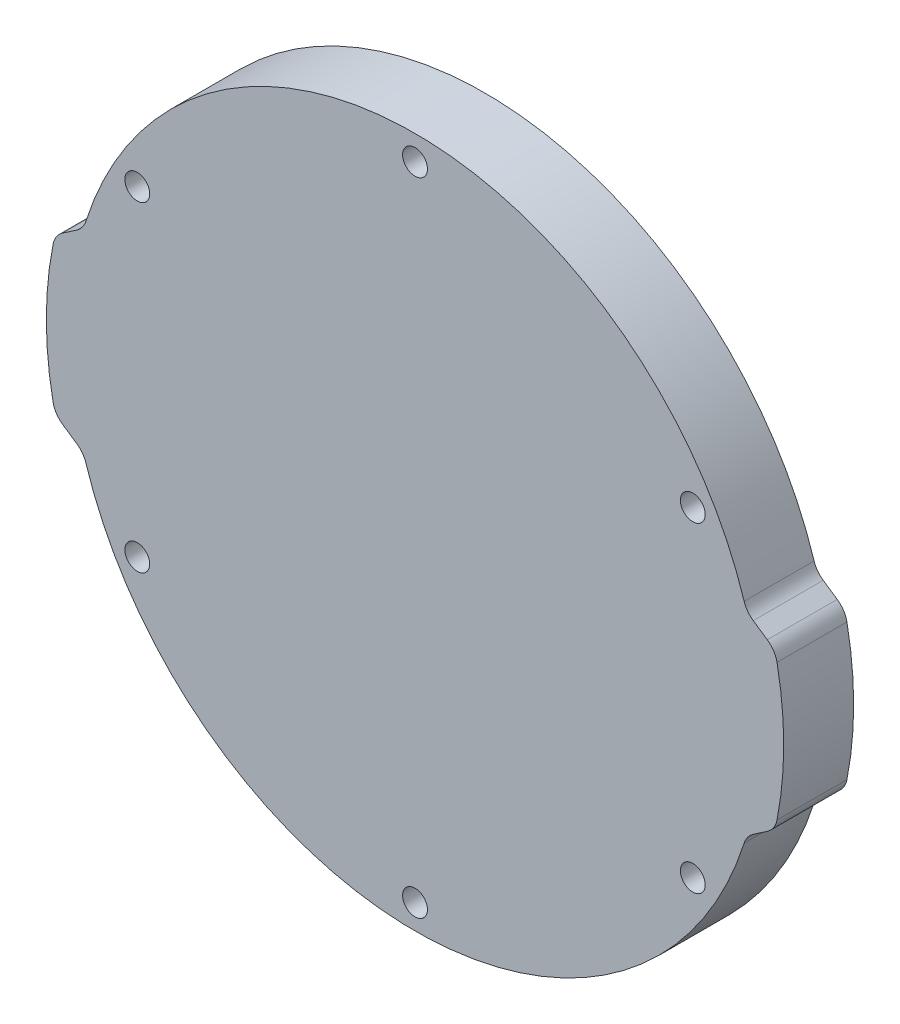
ISO-10303-21;
HEADER;
FILE_DESCRIPTION(('STEP AP214'),'2;1');
FILE_NAME('part.step','',(''),(''),'','','');
FILE_SCHEMA(('AUTOMOTIVE_DESIGN { 1 0 10303 214 1 1 1 1 }'));
ENDSEC;
DATA;
#1=APPLICATION_CONTEXT('core data for automotive mechanical design processes');
#2=APPLICATION_PROTOCOL_DEFINITION('international standard','automotive_design',2000,#1);
#3=PRODUCT_CONTEXT('',#1,'mechanical');
#4=PRODUCT('Part','Part','',(#3));
#5=PRODUCT_RELATED_PRODUCT_CATEGORY('part','',(#4));
#6=PRODUCT_DEFINITION_FORMATION('','',#4);
#7=PRODUCT_DEFINITION_CONTEXT('part definition',#1,'design');
#8=PRODUCT_DEFINITION('design','',#6,#7);
#9=PRODUCT_DEFINITION_SHAPE('','',#8);
#10=(LENGTH_UNIT() NAMED_UNIT(*) SI_UNIT(.MILLI.,.METRE.));
#11=(NAMED_UNIT(*) PLANE_ANGLE_UNIT() SI_UNIT($,.RADIAN.));
#12=(NAMED_UNIT(*) SI_UNIT($,.STERADIAN.) SOLID_ANGLE_UNIT());
#13=UNCERTAINTY_MEASURE_WITH_UNIT(LENGTH_MEASURE(1.E-05),#10,'distance_accuracy_value','');
#14=(GEOMETRIC_REPRESENTATION_CONTEXT(3) GLOBAL_UNCERTAINTY_ASSIGNED_CONTEXT((#13)) GLOBAL_UNIT_ASSIGNED_CONTEXT((#10,
#11,#12)) REPRESENTATION_CONTEXT('',''));
#15=CARTESIAN_POINT('',(0.,0.,0.));
#16=DIRECTION('',(0.,0.,1.));
#17=DIRECTION('',(1.,0.,0.));
#18=AXIS2_PLACEMENT_3D('',#15,#16,#17);
#19=CARTESIAN_POINT('',(2.45,0.,9.));
#20=DIRECTION('',(0.,0.,-1.));
#21=DIRECTION('',(-1.,0.,0.));
#22=AXIS2_PLACEMENT_3D('',#19,#20,#21);
#23=PLANE('',#22);
#24=CARTESIAN_POINT('',(5.11138805749817E-12,-41.2750000000005,9.));
#25=DIRECTION('',(0.,0.,1.));
#26=DIRECTION('',(1.,0.,0.));
#27=AXIS2_PLACEMENT_3D('',#24,#25,#26);
#28=CIRCLE('',#27,1.6);
#29=CARTESIAN_POINT('',(1.60000000000511,-41.2750000000005,9.));
#30=VERTEX_POINT('',#29);
#31=EDGE_CURVE('E643',#30,#30,#28,.T.);
#32=ORIENTED_EDGE('',*,*,#31,.F.);
#33=EDGE_LOOP('',(#32));
#34=FACE_BOUND('',#33,.T.);
#35=CARTESIAN_POINT('',(35.7451985412042,20.6375000000021,9.));
#36=DIRECTION('',(0.,0.,1.));
#37=DIRECTION('',(1.,0.,0.));
#38=AXIS2_PLACEMENT_3D('',#35,#36,#37);
#39=CIRCLE('',#38,1.59999999999999);
#40=CARTESIAN_POINT('',(37.3451985412042,20.6375000000021,9.));
#41=VERTEX_POINT('',#40);
#42=EDGE_CURVE('E629',#41,#41,#39,.T.);
#43=ORIENTED_EDGE('',*,*,#42,.F.);
#44=EDGE_LOOP('',(#43));
#45=FACE_BOUND('',#44,.T.);
#46=CARTESIAN_POINT('',(0.,41.275,9.));
#47=DIRECTION('',(0.,0.,1.));
#48=DIRECTION('',(1.,0.,0.));
#49=AXIS2_PLACEMENT_3D('',#46,#47,#48);
#50=CIRCLE('',#49,1.6);
#51=CARTESIAN_POINT('',(1.6,41.275,9.));
#52=VERTEX_POINT('',#51);
#53=EDGE_CURVE('E182',#52,#52,#50,.T.);
#54=ORIENTED_EDGE('',*,*,#53,.F.);
#55=EDGE_LOOP('',(#54));
#56=FACE_BOUND('',#55,.T.);
#57=DIRECTION('',(0.826366164777737,0.563133165166584,0.));
#58=VECTOR('',#57,1.);
#59=CARTESIAN_POINT('',(46.3248219369606,-10.,9.));
#60=LINE('',#59,#58);
#61=CARTESIAN_POINT('',(43.5274449449631,-11.9062926663889,9.));
#62=VERTEX_POINT('',#61);
#63=CARTESIAN_POINT('',(45.3315955176947,-10.6768412854351,9.));
#64=VERTEX_POINT('',#63);
#65=EDGE_CURVE('E195',#62,#64,#60,.T.);
#66=ORIENTED_EDGE('',*,*,#65,.T.);
#67=CARTESIAN_POINT('',(43.642196022195,-8.19774279110192,9.));
#68=DIRECTION('',(0.,0.,-1.));
#69=DIRECTION('',(-1.,0.,0.));
#70=AXIS2_PLACEMENT_3D('',#67,#68,#69);
#71=CIRCLE('',#70,3.);
#72=CARTESIAN_POINT('',(46.584495738066,-8.7832958476092,9.));
#73=VERTEX_POINT('',#72);
#74=EDGE_CURVE('E241',#64,#73,#71,.F.);
#75=ORIENTED_EDGE('',*,*,#74,.T.);
#76=CARTESIAN_POINT('',(2.45,0.,9.));
#77=DIRECTION('',(0.,0.,1.));
#78=DIRECTION('',(-1.,0.,0.));
#79=AXIS2_PLACEMENT_3D('',#76,#77,#78);
#80=CIRCLE('',#79,45.);
#81=CARTESIAN_POINT('',(46.584495738066,8.78329584760921,9.));
#82=VERTEX_POINT('',#81);
#83=EDGE_CURVE('E172',#73,#82,#80,.T.);
#84=ORIENTED_EDGE('',*,*,#83,.T.);
#85=CARTESIAN_POINT('',(43.642196022195,8.19774279110193,9.));
#86=DIRECTION('',(0.,0.,-1.));
#87=DIRECTION('',(-1.,0.,0.));
#88=AXIS2_PLACEMENT_3D('',#85,#86,#87);
#89=CIRCLE('',#88,3.);
#90=CARTESIAN_POINT('',(45.3315955176947,10.6768412854351,9.));
#91=VERTEX_POINT('',#90);
#92=EDGE_CURVE('E238',#82,#91,#89,.F.);
#93=ORIENTED_EDGE('',*,*,#92,.T.);
#94=DIRECTION('',(-0.826366164777736,0.563133165166585,0.));
#95=VECTOR('',#94,1.);
#96=CARTESIAN_POINT('',(46.3248219369606,10.,9.));
#97=LINE('',#96,#95);
#98=CARTESIAN_POINT('',(43.5274449449631,11.9062926663889,9.));
#99=VERTEX_POINT('',#98);
#100=EDGE_CURVE('E332',#91,#99,#97,.T.);
#101=ORIENTED_EDGE('',*,*,#100,.T.);
#102=CARTESIAN_POINT('',(45.2168444404629,14.3853911607221,9.));
#103=DIRECTION('',(0.,0.,-1.));
#104=DIRECTION('',(-1.,0.,0.));
#105=AXIS2_PLACEMENT_3D('',#102,#103,#104);
#106=CIRCLE('',#105,3.);
#107=CARTESIAN_POINT('',(42.3580344653019,13.4758827627839,9.));
#108=VERTEX_POINT('',#107);
#109=EDGE_CURVE('E288',#99,#108,#106,.T.);
#110=ORIENTED_EDGE('',*,*,#109,.T.);
#111=CARTESIAN_POINT('',(0.,0.,9.));
#112=DIRECTION('',(0.,0.,1.));
#113=DIRECTION('',(1.,0.,0.));
#114=AXIS2_PLACEMENT_3D('',#111,#112,#113);
#115=CIRCLE('',#114,44.45);
#116=CARTESIAN_POINT('',(-42.3580344653019,13.4758827627839,9.));
#117=VERTEX_POINT('',#116);
#118=EDGE_CURVE('E321',#108,#117,#115,.T.);
#119=ORIENTED_EDGE('',*,*,#118,.T.);
#120=CARTESIAN_POINT('',(-45.2168444404629,14.3853911607221,9.));
#121=DIRECTION('',(0.,0.,-1.));
#122=DIRECTION('',(-1.,0.,0.));
#123=AXIS2_PLACEMENT_3D('',#120,#121,#122);
#124=CIRCLE('',#123,3.);
#125=CARTESIAN_POINT('',(-43.5274449449631,11.9062926663889,9.));
#126=VERTEX_POINT('',#125);
#127=EDGE_CURVE('E11',#117,#126,#124,.T.);
#128=ORIENTED_EDGE('',*,*,#127,.T.);
#129=DIRECTION('',(-0.826366164777736,-0.563133165166585,0.));
#130=VECTOR('',#129,1.);
#131=CARTESIAN_POINT('',(-46.3248219369606,10.,9.));
#132=LINE('',#131,#130);
#133=CARTESIAN_POINT('',(-45.3315955176947,10.6768412854351,9.));
#134=VERTEX_POINT('',#133);
#135=EDGE_CURVE('E319',#126,#134,#132,.T.);
#136=ORIENTED_EDGE('',*,*,#135,.T.);
#137=CARTESIAN_POINT('',(-43.642196022195,8.19774279110193,9.));
#138=DIRECTION('',(0.,0.,-1.));
#139=DIRECTION('',(-1.,0.,0.));
#140=AXIS2_PLACEMENT_3D('',#137,#138,#139);
#141=CIRCLE('',#140,3.);
#142=CARTESIAN_POINT('',(-46.584495738066,8.78329584760921,9.));
#143=VERTEX_POINT('',#142);
#144=EDGE_CURVE('E232',#134,#143,#141,.F.);
#145=ORIENTED_EDGE('',*,*,#144,.T.);
#146=CARTESIAN_POINT('',(-2.45,0.,9.));
#147=DIRECTION('',(0.,0.,1.));
#148=DIRECTION('',(1.,0.,0.));
#149=AXIS2_PLACEMENT_3D('',#146,#147,#148);
#150=CIRCLE('',#149,45.);
#151=CARTESIAN_POINT('',(-46.584495738066,-8.78329584760921,9.));
#152=VERTEX_POINT('',#151);
#153=EDGE_CURVE('E325',#143,#152,#150,.T.);
#154=ORIENTED_EDGE('',*,*,#153,.T.);
#155=CARTESIAN_POINT('',(-43.642196022195,-8.19774279110193,9.));
#156=DIRECTION('',(0.,0.,-1.));
#157=DIRECTION('',(-1.,0.,0.));
#158=AXIS2_PLACEMENT_3D('',#155,#156,#157);
#159=CIRCLE('',#158,3.);
#160=CARTESIAN_POINT('',(-45.3315955176947,-10.6768412854351,9.));
#161=VERTEX_POINT('',#160);
#162=EDGE_CURVE('E235',#152,#161,#159,.F.);
#163=ORIENTED_EDGE('',*,*,#162,.T.);
#164=DIRECTION('',(0.826366164777736,-0.563133165166585,0.));
#165=VECTOR('',#164,1.);
#166=CARTESIAN_POINT('',(-46.3248219369606,-10.,9.));
#167=LINE('',#166,#165);
#168=CARTESIAN_POINT('',(-43.5274449449631,-11.9062926663889,9.));
#169=VERTEX_POINT('',#168);
#170=EDGE_CURVE('E329',#161,#169,#167,.T.);
#171=ORIENTED_EDGE('',*,*,#170,.T.);
#172=CARTESIAN_POINT('',(-45.2168444404629,-14.3853911607221,9.));
#173=DIRECTION('',(0.,0.,-1.));
#174=DIRECTION('',(-1.,0.,0.));
#175=AXIS2_PLACEMENT_3D('',#172,#173,#174);
#176=CIRCLE('',#175,3.);
#177=CARTESIAN_POINT('',(-42.3580344653019,-13.4758827627839,9.));
#178=VERTEX_POINT('',#177);
#179=EDGE_CURVE('E59',#169,#178,#176,.T.);
#180=ORIENTED_EDGE('',*,*,#179,.T.);
#181=CARTESIAN_POINT('',(0.,0.,9.));
#182=DIRECTION('',(0.,0.,1.));
#183=DIRECTION('',(1.,0.,0.));
#184=AXIS2_PLACEMENT_3D('',#181,#182,#183);
#185=CIRCLE('',#184,44.45);
#186=CARTESIAN_POINT('',(42.3580344653019,-13.4758827627839,9.));
#187=VERTEX_POINT('',#186);
#188=EDGE_CURVE('E337',#178,#187,#185,.T.);
#189=ORIENTED_EDGE('',*,*,#188,.T.);
#190=CARTESIAN_POINT('',(45.2168444404629,-14.3853911607221,9.));
#191=DIRECTION('',(0.,0.,-1.));
#192=DIRECTION('',(-1.,0.,0.));
#193=AXIS2_PLACEMENT_3D('',#190,#191,#192);
#194=CIRCLE('',#193,3.);
#195=EDGE_CURVE('E294',#187,#62,#194,.T.);
#196=ORIENTED_EDGE('',*,*,#195,.T.);
#197=EDGE_LOOP('',(#66,#75,#84,#93,#101,#110,#119,#128,#136,#145,#154,#163,#171,#180,#189,#196));
#198=FACE_BOUND('',#197,.T.);
#199=CARTESIAN_POINT('',(-35.7451985411991,-20.6375000000026,9.));
#200=DIRECTION('',(0.,0.,1.));
#201=DIRECTION('',(1.,0.,0.));
#202=AXIS2_PLACEMENT_3D('',#199,#200,#201);
#203=CIRCLE('',#202,1.6);
#204=CARTESIAN_POINT('',(-34.1451985411991,-20.6375000000026,9.));
#205=VERTEX_POINT('',#204);
#206=EDGE_CURVE('E611',#205,#205,#203,.T.);
#207=ORIENTED_EDGE('',*,*,#206,.F.);
#208=EDGE_LOOP('',(#207));
#209=FACE_BOUND('',#208,.T.);
#210=CARTESIAN_POINT('',(35.7451985412068,-20.6374999999982,9.));
#211=DIRECTION('',(0.,0.,1.));
#212=DIRECTION('',(1.,0.,0.));
#213=AXIS2_PLACEMENT_3D('',#210,#211,#212);
#214=CIRCLE('',#213,1.6);
#215=CARTESIAN_POINT('',(37.3451985412068,-20.6374999999982,9.));
#216=VERTEX_POINT('',#215);
#217=EDGE_CURVE('E638',#216,#216,#214,.T.);
#218=ORIENTED_EDGE('',*,*,#217,.F.);
#219=EDGE_LOOP('',(#218));
#220=FACE_BOUND('',#219,.T.);
#221=CARTESIAN_POINT('',(-35.7451985412017,20.6374999999976,9.));
#222=DIRECTION('',(0.,0.,1.));
#223=DIRECTION('',(1.,0.,0.));
#224=AXIS2_PLACEMENT_3D('',#221,#222,#223);
#225=CIRCLE('',#224,1.59999999999999);
#226=CARTESIAN_POINT('',(-34.1451985412017,20.6374999999976,9.));
#227=VERTEX_POINT('',#226);
#228=EDGE_CURVE('E650',#227,#227,#225,.T.);
#229=ORIENTED_EDGE('',*,*,#228,.F.);
#230=EDGE_LOOP('',(#229));
#231=FACE_BOUND('',#230,.T.);
#232=ADVANCED_FACE('F36',(#34,#45,#56,#198,#209,#220,#231),#23,.F.);
#233=CARTESIAN_POINT('',(2.45,0.,0.));
#234=DIRECTION('',(0.,0.,-1.));
#235=DIRECTION('',(-1.,0.,0.));
#236=AXIS2_PLACEMENT_3D('',#233,#234,#235);
#237=PLANE('',#236);
#238=CARTESIAN_POINT('',(5.11138805749817E-12,-41.2750000000005,0.));
#239=DIRECTION('',(0.,0.,1.));
#240=DIRECTION('',(1.,0.,0.));
#241=AXIS2_PLACEMENT_3D('',#238,#239,#240);
#242=CIRCLE('',#241,1.6);
#243=CARTESIAN_POINT('',(1.60000000000511,-41.2750000000005,0.));
#244=VERTEX_POINT('',#243);
#245=EDGE_CURVE('E646',#244,#244,#242,.T.);
#246=ORIENTED_EDGE('',*,*,#245,.T.);
#247=EDGE_LOOP('',(#246));
#248=FACE_BOUND('',#247,.T.);
#249=CARTESIAN_POINT('',(35.7451985412042,20.6375000000021,0.));
#250=DIRECTION('',(0.,0.,1.));
#251=DIRECTION('',(1.,0.,0.));
#252=AXIS2_PLACEMENT_3D('',#249,#250,#251);
#253=CIRCLE('',#252,1.59999999999999);
#254=CARTESIAN_POINT('',(37.3451985412042,20.6375000000021,0.));
#255=VERTEX_POINT('',#254);
#256=EDGE_CURVE('E633',#255,#255,#253,.T.);
#257=ORIENTED_EDGE('',*,*,#256,.T.);
#258=EDGE_LOOP('',(#257));
#259=FACE_BOUND('',#258,.T.);
#260=CARTESIAN_POINT('',(0.,41.275,0.));
#261=DIRECTION('',(0.,0.,1.));
#262=DIRECTION('',(1.,0.,0.));
#263=AXIS2_PLACEMENT_3D('',#260,#261,#262);
#264=CIRCLE('',#263,1.6);
#265=CARTESIAN_POINT('',(1.6,41.275,0.));
#266=VERTEX_POINT('',#265);
#267=EDGE_CURVE('E192',#266,#266,#264,.T.);
#268=ORIENTED_EDGE('',*,*,#267,.T.);
#269=EDGE_LOOP('',(#268));
#270=FACE_BOUND('',#269,.T.);
#271=CARTESIAN_POINT('',(2.45,0.,0.));
#272=DIRECTION('',(0.,0.,1.));
#273=DIRECTION('',(-1.,0.,0.));
#274=AXIS2_PLACEMENT_3D('',#271,#272,#273);
#275=CIRCLE('',#274,45.);
#276=CARTESIAN_POINT('',(46.584495738066,-8.7832958476092,0.));
#277=VERTEX_POINT('',#276);
#278=CARTESIAN_POINT('',(46.584495738066,8.78329584760921,0.));
#279=VERTEX_POINT('',#278);
#280=EDGE_CURVE('E169',#277,#279,#275,.T.);
#281=ORIENTED_EDGE('',*,*,#280,.F.);
#282=CARTESIAN_POINT('',(43.642196022195,-8.19774279110192,0.));
#283=DIRECTION('',(0.,0.,-1.));
#284=DIRECTION('',(-1.,0.,0.));
#285=AXIS2_PLACEMENT_3D('',#282,#283,#284);
#286=CIRCLE('',#285,3.);
#287=CARTESIAN_POINT('',(45.3315955176947,-10.6768412854351,0.));
#288=VERTEX_POINT('',#287);
#289=EDGE_CURVE('E151',#277,#288,#286,.T.);
#290=ORIENTED_EDGE('',*,*,#289,.T.);
#291=DIRECTION('',(0.826366164777737,0.563133165166584,0.));
#292=VECTOR('',#291,1.);
#293=CARTESIAN_POINT('',(46.3248219369606,-10.,0.));
#294=LINE('',#293,#292);
#295=CARTESIAN_POINT('',(43.5274449449631,-11.9062926663889,0.));
#296=VERTEX_POINT('',#295);
#297=EDGE_CURVE('E215',#296,#288,#294,.T.);
#298=ORIENTED_EDGE('',*,*,#297,.F.);
#299=CARTESIAN_POINT('',(45.2168444404629,-14.3853911607221,0.));
#300=DIRECTION('',(0.,0.,-1.));
#301=DIRECTION('',(-1.,0.,0.));
#302=AXIS2_PLACEMENT_3D('',#299,#300,#301);
#303=CIRCLE('',#302,3.);
#304=CARTESIAN_POINT('',(42.3580344653019,-13.4758827627839,0.));
#305=VERTEX_POINT('',#304);
#306=EDGE_CURVE('E291',#296,#305,#303,.F.);
#307=ORIENTED_EDGE('',*,*,#306,.T.);
#308=CARTESIAN_POINT('',(0.,0.,0.));
#309=DIRECTION('',(0.,0.,1.));
#310=DIRECTION('',(1.,0.,0.));
#311=AXIS2_PLACEMENT_3D('',#308,#309,#310);
#312=CIRCLE('',#311,44.45);
#313=CARTESIAN_POINT('',(-42.3580344653019,-13.4758827627839,0.));
#314=VERTEX_POINT('',#313);
#315=EDGE_CURVE('E212',#314,#305,#312,.T.);
#316=ORIENTED_EDGE('',*,*,#315,.F.);
#317=CARTESIAN_POINT('',(-45.2168444404629,-14.3853911607221,0.));
#318=DIRECTION('',(0.,0.,-1.));
#319=DIRECTION('',(-1.,0.,0.));
#320=AXIS2_PLACEMENT_3D('',#317,#318,#319);
#321=CIRCLE('',#320,3.);
#322=CARTESIAN_POINT('',(-43.5274449449631,-11.9062926663889,0.));
#323=VERTEX_POINT('',#322);
#324=EDGE_CURVE('E297',#314,#323,#321,.F.);
#325=ORIENTED_EDGE('',*,*,#324,.T.);
#326=DIRECTION('',(0.826366164777736,-0.563133165166585,0.));
#327=VECTOR('',#326,1.);
#328=CARTESIAN_POINT('',(-46.3248219369606,-10.,0.));
#329=LINE('',#328,#327);
#330=CARTESIAN_POINT('',(-45.3315955176947,-10.6768412854351,0.));
#331=VERTEX_POINT('',#330);
#332=EDGE_CURVE('E209',#331,#323,#329,.T.);
#333=ORIENTED_EDGE('',*,*,#332,.F.);
#334=CARTESIAN_POINT('',(-43.642196022195,-8.19774279110193,0.));
#335=DIRECTION('',(0.,0.,-1.));
#336=DIRECTION('',(-1.,0.,0.));
#337=AXIS2_PLACEMENT_3D('',#334,#335,#336);
#338=CIRCLE('',#337,3.);
#339=CARTESIAN_POINT('',(-46.584495738066,-8.78329584760921,0.));
#340=VERTEX_POINT('',#339);
#341=EDGE_CURVE('E222',#331,#340,#338,.T.);
#342=ORIENTED_EDGE('',*,*,#341,.T.);
#343=CARTESIAN_POINT('',(-2.45,0.,0.));
#344=DIRECTION('',(0.,0.,1.));
#345=DIRECTION('',(1.,0.,0.));
#346=AXIS2_PLACEMENT_3D('',#343,#344,#345);
#347=CIRCLE('',#346,45.);
#348=CARTESIAN_POINT('',(-46.584495738066,8.78329584760921,0.));
#349=VERTEX_POINT('',#348);
#350=EDGE_CURVE('E205',#349,#340,#347,.T.);
#351=ORIENTED_EDGE('',*,*,#350,.F.);
#352=CARTESIAN_POINT('',(-43.642196022195,8.19774279110193,0.));
#353=DIRECTION('',(0.,0.,-1.));
#354=DIRECTION('',(-1.,0.,0.));
#355=AXIS2_PLACEMENT_3D('',#352,#353,#354);
#356=CIRCLE('',#355,3.);
#357=CARTESIAN_POINT('',(-45.3315955176947,10.6768412854351,0.));
#358=VERTEX_POINT('',#357);
#359=EDGE_CURVE('E174',#349,#358,#356,.T.);
#360=ORIENTED_EDGE('',*,*,#359,.T.);
#361=DIRECTION('',(-0.826366164777736,-0.563133165166585,0.));
#362=VECTOR('',#361,1.);
#363=CARTESIAN_POINT('',(-46.3248219369606,10.,0.));
#364=LINE('',#363,#362);
#365=CARTESIAN_POINT('',(-43.5274449449631,11.9062926663889,0.));
#366=VERTEX_POINT('',#365);
#367=EDGE_CURVE('E201',#366,#358,#364,.T.);
#368=ORIENTED_EDGE('',*,*,#367,.F.);
#369=CARTESIAN_POINT('',(-45.2168444404629,14.3853911607221,0.));
#370=DIRECTION('',(0.,0.,-1.));
#371=DIRECTION('',(-1.,0.,0.));
#372=AXIS2_PLACEMENT_3D('',#369,#370,#371);
#373=CIRCLE('',#372,3.);
#374=CARTESIAN_POINT('',(-42.3580344653019,13.4758827627839,0.));
#375=VERTEX_POINT('',#374);
#376=EDGE_CURVE('E45',#366,#375,#373,.F.);
#377=ORIENTED_EDGE('',*,*,#376,.T.);
#378=CARTESIAN_POINT('',(0.,0.,0.));
#379=DIRECTION('',(0.,0.,1.));
#380=DIRECTION('',(1.,0.,0.));
#381=AXIS2_PLACEMENT_3D('',#378,#379,#380);
#382=CIRCLE('',#381,44.45);
#383=CARTESIAN_POINT('',(42.3580344653019,13.4758827627839,0.));
#384=VERTEX_POINT('',#383);
#385=EDGE_CURVE('E188',#384,#375,#382,.T.);
#386=ORIENTED_EDGE('',*,*,#385,.F.);
#387=CARTESIAN_POINT('',(45.2168444404629,14.3853911607221,0.));
#388=DIRECTION('',(0.,0.,-1.));
#389=DIRECTION('',(-1.,0.,0.));
#390=AXIS2_PLACEMENT_3D('',#387,#388,#389);
#391=CIRCLE('',#390,3.);
#392=CARTESIAN_POINT('',(43.5274449449631,11.9062926663889,0.));
#393=VERTEX_POINT('',#392);
#394=EDGE_CURVE('E285',#384,#393,#391,.F.);
#395=ORIENTED_EDGE('',*,*,#394,.T.);
#396=DIRECTION('',(-0.826366164777736,0.563133165166585,0.));
#397=VECTOR('',#396,1.);
#398=CARTESIAN_POINT('',(46.3248219369606,10.,0.));
#399=LINE('',#398,#397);
#400=CARTESIAN_POINT('',(45.3315955176947,10.6768412854351,0.));
#401=VERTEX_POINT('',#400);
#402=EDGE_CURVE('E181',#401,#393,#399,.T.);
#403=ORIENTED_EDGE('',*,*,#402,.F.);
#404=CARTESIAN_POINT('',(43.642196022195,8.19774279110193,0.));
#405=DIRECTION('',(0.,0.,-1.));
#406=DIRECTION('',(-1.,0.,0.));
#407=AXIS2_PLACEMENT_3D('',#404,#405,#406);
#408=CIRCLE('',#407,3.);
#409=EDGE_CURVE('E163',#401,#279,#408,.T.);
#410=ORIENTED_EDGE('',*,*,#409,.T.);
#411=EDGE_LOOP('',(#281,#290,#298,#307,#316,#325,#333,#342,#351,#360,#368,#377,#386,#395,#403,#410));
#412=FACE_BOUND('',#411,.T.);
#413=CARTESIAN_POINT('',(-35.7451985411991,-20.6375000000026,0.));
#414=DIRECTION('',(0.,0.,1.));
#415=DIRECTION('',(1.,0.,0.));
#416=AXIS2_PLACEMENT_3D('',#413,#414,#415);
#417=CIRCLE('',#416,1.6);
#418=CARTESIAN_POINT('',(-34.1451985411991,-20.6375000000026,0.));
#419=VERTEX_POINT('',#418);
#420=EDGE_CURVE('E615',#419,#419,#417,.T.);
#421=ORIENTED_EDGE('',*,*,#420,.T.);
#422=EDGE_LOOP('',(#421));
#423=FACE_BOUND('',#422,.T.);
#424=CARTESIAN_POINT('',(35.7451985412068,-20.6374999999982,0.));
#425=DIRECTION('',(0.,0.,1.));
#426=DIRECTION('',(1.,0.,0.));
#427=AXIS2_PLACEMENT_3D('',#424,#425,#426);
#428=CIRCLE('',#427,1.6);
#429=CARTESIAN_POINT('',(37.3451985412068,-20.6374999999982,0.));
#430=VERTEX_POINT('',#429);
#431=EDGE_CURVE('E640',#430,#430,#428,.T.);
#432=ORIENTED_EDGE('',*,*,#431,.T.);
#433=EDGE_LOOP('',(#432));
#434=FACE_BOUND('',#433,.T.);
#435=CARTESIAN_POINT('',(-35.7451985412017,20.6374999999976,0.));
#436=DIRECTION('',(0.,0.,1.));
#437=DIRECTION('',(1.,0.,0.));
#438=AXIS2_PLACEMENT_3D('',#435,#436,#437);
#439=CIRCLE('',#438,1.59999999999999);
#440=CARTESIAN_POINT('',(-34.1451985412017,20.6374999999976,0.));
#441=VERTEX_POINT('',#440);
#442=EDGE_CURVE('E654',#441,#441,#439,.T.);
#443=ORIENTED_EDGE('',*,*,#442,.T.);
#444=EDGE_LOOP('',(#443));
#445=FACE_BOUND('',#444,.T.);
#446=ADVANCED_FACE('F177',(#248,#259,#270,#412,#423,#434,#445),#237,.T.);
#447=CARTESIAN_POINT('',(2.45,0.,9.));
#448=DIRECTION('',(0.,0.,-1.));
#449=DIRECTION('',(-1.,0.,0.));
#450=AXIS2_PLACEMENT_3D('',#447,#448,#449);
#451=CYLINDRICAL_SURFACE('',#450,45.);
#452=ORIENTED_EDGE('',*,*,#83,.F.);
#453=DIRECTION('',(0.,0.,-1.));
#454=VECTOR('',#453,1.);
#455=CARTESIAN_POINT('',(46.5844957380661,-8.7832958476092,9.));
#456=LINE('',#455,#454);
#457=EDGE_CURVE('E155',#73,#277,#456,.T.);
#458=ORIENTED_EDGE('',*,*,#457,.T.);
#459=ORIENTED_EDGE('',*,*,#280,.T.);
#460=DIRECTION('',(0.,0.,-1.));
#461=VECTOR('',#460,1.);
#462=CARTESIAN_POINT('',(46.5844957380661,8.78329584760921,9.));
#463=LINE('',#462,#461);
#464=EDGE_CURVE('E175',#279,#82,#463,.F.);
#465=ORIENTED_EDGE('',*,*,#464,.T.);
#466=EDGE_LOOP('',(#452,#458,#459,#465));
#467=FACE_BOUND('',#466,.T.);
#468=ADVANCED_FACE('F168',(#467),#451,.T.);
#469=CARTESIAN_POINT('',(46.3248219369606,10.,9.));
#470=DIRECTION('',(-0.563133165166585,-0.826366164777735,0.));
#471=DIRECTION('',(0.826366164777735,-0.563133165166585,0.));
#472=AXIS2_PLACEMENT_3D('',#469,#470,#471);
#473=PLANE('',#472);
#474=ORIENTED_EDGE('',*,*,#100,.F.);
#475=DIRECTION('',(0.,0.,-1.));
#476=VECTOR('',#475,1.);
#477=CARTESIAN_POINT('',(45.3315955176947,10.6768412854351,9.));
#478=LINE('',#477,#476);
#479=EDGE_CURVE('E247',#91,#401,#478,.T.);
#480=ORIENTED_EDGE('',*,*,#479,.T.);
#481=ORIENTED_EDGE('',*,*,#402,.T.);
#482=DIRECTION('',(0.,0.,1.));
#483=VECTOR('',#482,1.);
#484=CARTESIAN_POINT('',(43.5274449449631,11.9062926663889,9.));
#485=LINE('',#484,#483);
#486=EDGE_CURVE('E244',#393,#99,#485,.T.);
#487=ORIENTED_EDGE('',*,*,#486,.T.);
#488=EDGE_LOOP('',(#474,#480,#481,#487));
#489=FACE_BOUND('',#488,.T.);
#490=ADVANCED_FACE('F399',(#489),#473,.F.);
#491=CARTESIAN_POINT('',(0.,0.,9.));
#492=DIRECTION('',(0.,0.,-1.));
#493=DIRECTION('',(-1.,0.,0.));
#494=AXIS2_PLACEMENT_3D('',#491,#492,#493);
#495=CYLINDRICAL_SURFACE('',#494,44.45);
#496=ORIENTED_EDGE('',*,*,#118,.F.);
#497=DIRECTION('',(0.,0.,-1.));
#498=VECTOR('',#497,1.);
#499=CARTESIAN_POINT('',(42.3580344653019,13.4758827627839,9.));
#500=LINE('',#499,#498);
#501=EDGE_CURVE('E254',#108,#384,#500,.T.);
#502=ORIENTED_EDGE('',*,*,#501,.T.);
#503=ORIENTED_EDGE('',*,*,#385,.T.);
#504=DIRECTION('',(0.,0.,-1.));
#505=VECTOR('',#504,1.);
#506=CARTESIAN_POINT('',(-42.3580344653019,13.4758827627839,9.));
#507=LINE('',#506,#505);
#508=EDGE_CURVE('E251',#375,#117,#507,.F.);
#509=ORIENTED_EDGE('',*,*,#508,.T.);
#510=EDGE_LOOP('',(#496,#502,#503,#509));
#511=FACE_BOUND('',#510,.T.);
#512=ADVANCED_FACE('F310',(#511),#495,.T.);
#513=CARTESIAN_POINT('',(-46.3248219369606,10.,9.));
#514=DIRECTION('',(0.563133165166585,-0.826366164777735,0.));
#515=DIRECTION('',(0.826366164777735,0.563133165166585,0.));
#516=AXIS2_PLACEMENT_3D('',#513,#514,#515);
#517=PLANE('',#516);
#518=ORIENTED_EDGE('',*,*,#135,.F.);
#519=DIRECTION('',(0.,0.,1.));
#520=VECTOR('',#519,1.);
#521=CARTESIAN_POINT('',(-43.5274449449631,11.9062926663889,0.));
#522=LINE('',#521,#520);
#523=EDGE_CURVE('E281',#126,#366,#522,.F.);
#524=ORIENTED_EDGE('',*,*,#523,.T.);
#525=ORIENTED_EDGE('',*,*,#367,.T.);
#526=DIRECTION('',(0.,0.,-1.));
#527=VECTOR('',#526,1.);
#528=CARTESIAN_POINT('',(-45.3315955176947,10.6768412854351,9.));
#529=LINE('',#528,#527);
#530=EDGE_CURVE('E278',#358,#134,#529,.F.);
#531=ORIENTED_EDGE('',*,*,#530,.T.);
#532=EDGE_LOOP('',(#518,#524,#525,#531));
#533=FACE_BOUND('',#532,.T.);
#534=ADVANCED_FACE('F323',(#533),#517,.F.);
#535=CARTESIAN_POINT('',(-2.45,0.,9.));
#536=DIRECTION('',(0.,0.,-1.));
#537=DIRECTION('',(-1.,0.,0.));
#538=AXIS2_PLACEMENT_3D('',#535,#536,#537);
#539=CYLINDRICAL_SURFACE('',#538,45.);
#540=ORIENTED_EDGE('',*,*,#350,.T.);
#541=DIRECTION('',(0.,0.,-1.));
#542=VECTOR('',#541,1.);
#543=CARTESIAN_POINT('',(-46.5844957380661,-8.78329584760921,9.));
#544=LINE('',#543,#542);
#545=EDGE_CURVE('E275',#340,#152,#544,.F.);
#546=ORIENTED_EDGE('',*,*,#545,.T.);
#547=ORIENTED_EDGE('',*,*,#153,.F.);
#548=DIRECTION('',(0.,0.,-1.));
#549=VECTOR('',#548,1.);
#550=CARTESIAN_POINT('',(-46.5844957380661,8.78329584760921,9.));
#551=LINE('',#550,#549);
#552=EDGE_CURVE('E271',#143,#349,#551,.T.);
#553=ORIENTED_EDGE('',*,*,#552,.T.);
#554=EDGE_LOOP('',(#540,#546,#547,#553));
#555=FACE_BOUND('',#554,.T.);
#556=ADVANCED_FACE('F365',(#555),#539,.T.);
#557=CARTESIAN_POINT('',(-46.3248219369606,-10.,9.));
#558=DIRECTION('',(0.563133165166585,0.826366164777735,0.));
#559=DIRECTION('',(-0.826366164777735,0.563133165166585,0.));
#560=AXIS2_PLACEMENT_3D('',#557,#558,#559);
#561=PLANE('',#560);
#562=ORIENTED_EDGE('',*,*,#332,.T.);
#563=DIRECTION('',(0.,0.,1.));
#564=VECTOR('',#563,1.);
#565=CARTESIAN_POINT('',(-43.5274449449631,-11.9062926663889,9.));
#566=LINE('',#565,#564);
#567=EDGE_CURVE('E268',#323,#169,#566,.T.);
#568=ORIENTED_EDGE('',*,*,#567,.T.);
#569=ORIENTED_EDGE('',*,*,#170,.F.);
#570=DIRECTION('',(0.,0.,-1.));
#571=VECTOR('',#570,1.);
#572=CARTESIAN_POINT('',(-45.3315955176947,-10.6768412854351,9.));
#573=LINE('',#572,#571);
#574=EDGE_CURVE('E264',#161,#331,#573,.T.);
#575=ORIENTED_EDGE('',*,*,#574,.T.);
#576=EDGE_LOOP('',(#562,#568,#569,#575));
#577=FACE_BOUND('',#576,.T.);
#578=ADVANCED_FACE('F356',(#577),#561,.F.);
#579=CARTESIAN_POINT('',(0.,0.,9.));
#580=DIRECTION('',(0.,0.,-1.));
#581=DIRECTION('',(-1.,0.,0.));
#582=AXIS2_PLACEMENT_3D('',#579,#580,#581);
#583=CYLINDRICAL_SURFACE('',#582,44.45);
#584=ORIENTED_EDGE('',*,*,#315,.T.);
#585=DIRECTION('',(0.,0.,-1.));
#586=VECTOR('',#585,1.);
#587=CARTESIAN_POINT('',(42.3580344653019,-13.4758827627839,9.));
#588=LINE('',#587,#586);
#589=EDGE_CURVE('E52',#305,#187,#588,.F.);
#590=ORIENTED_EDGE('',*,*,#589,.T.);
#591=ORIENTED_EDGE('',*,*,#188,.F.);
#592=DIRECTION('',(0.,0.,-1.));
#593=VECTOR('',#592,1.);
#594=CARTESIAN_POINT('',(-42.3580344653019,-13.4758827627839,9.));
#595=LINE('',#594,#593);
#596=EDGE_CURVE('E258',#178,#314,#595,.T.);
#597=ORIENTED_EDGE('',*,*,#596,.T.);
#598=EDGE_LOOP('',(#584,#590,#591,#597));
#599=FACE_BOUND('',#598,.T.);
#600=ADVANCED_FACE('F349',(#599),#583,.T.);
#601=CARTESIAN_POINT('',(46.3248219369606,-10.,9.));
#602=DIRECTION('',(-0.563133165166583,0.826366164777737,0.));
#603=DIRECTION('',(-0.826366164777737,-0.563133165166583,0.));
#604=AXIS2_PLACEMENT_3D('',#601,#602,#603);
#605=PLANE('',#604);
#606=ORIENTED_EDGE('',*,*,#297,.T.);
#607=DIRECTION('',(0.,0.,-1.));
#608=VECTOR('',#607,1.);
#609=CARTESIAN_POINT('',(45.3315955176947,-10.6768412854351,9.));
#610=LINE('',#609,#608);
#611=EDGE_CURVE('E156',#288,#64,#610,.F.);
#612=ORIENTED_EDGE('',*,*,#611,.T.);
#613=ORIENTED_EDGE('',*,*,#65,.F.);
#614=DIRECTION('',(0.,0.,1.));
#615=VECTOR('',#614,1.);
#616=CARTESIAN_POINT('',(43.5274449449631,-11.9062926663889,0.));
#617=LINE('',#616,#615);
#618=EDGE_CURVE('E162',#62,#296,#617,.F.);
#619=ORIENTED_EDGE('',*,*,#618,.T.);
#620=EDGE_LOOP('',(#606,#612,#613,#619));
#621=FACE_BOUND('',#620,.T.);
#622=ADVANCED_FACE('F345',(#621),#605,.F.);
#623=CARTESIAN_POINT('',(0.,41.275,9.));
#624=DIRECTION('',(0.,0.,-1.));
#625=DIRECTION('',(-1.,0.,0.));
#626=AXIS2_PLACEMENT_3D('',#623,#624,#625);
#627=CYLINDRICAL_SURFACE('',#626,1.6);
#628=ORIENTED_EDGE('',*,*,#53,.T.);
#629=EDGE_LOOP('',(#628));
#630=FACE_BOUND('',#629,.T.);
#631=ORIENTED_EDGE('',*,*,#267,.F.);
#632=EDGE_LOOP('',(#631));
#633=FACE_BOUND('',#632,.T.);
#634=ADVANCED_FACE('F384',(#630,#633),#627,.F.);
#635=CARTESIAN_POINT('',(-35.7451985411991,-20.6375000000026,9.));
#636=DIRECTION('',(0.,0.,-1.));
#637=DIRECTION('',(-1.,0.,0.));
#638=AXIS2_PLACEMENT_3D('',#635,#636,#637);
#639=CYLINDRICAL_SURFACE('',#638,1.6);
#640=ORIENTED_EDGE('',*,*,#206,.T.);
#641=EDGE_LOOP('',(#640));
#642=FACE_BOUND('',#641,.T.);
#643=ORIENTED_EDGE('',*,*,#420,.F.);
#644=EDGE_LOOP('',(#643));
#645=FACE_BOUND('',#644,.T.);
#646=ADVANCED_FACE('F509',(#642,#645),#639,.F.);
#647=CARTESIAN_POINT('',(35.7451985412042,20.6375000000021,9.));
#648=DIRECTION('',(0.,0.,-1.));
#649=DIRECTION('',(-1.,0.,0.));
#650=AXIS2_PLACEMENT_3D('',#647,#648,#649);
#651=CYLINDRICAL_SURFACE('',#650,1.59999999999999);
#652=ORIENTED_EDGE('',*,*,#42,.T.);
#653=EDGE_LOOP('',(#652));
#654=FACE_BOUND('',#653,.T.);
#655=ORIENTED_EDGE('',*,*,#256,.F.);
#656=EDGE_LOOP('',(#655));
#657=FACE_BOUND('',#656,.T.);
#658=ADVANCED_FACE('F499',(#654,#657),#651,.F.);
#659=CARTESIAN_POINT('',(35.7451985412068,-20.6374999999982,9.));
#660=DIRECTION('',(0.,0.,-1.));
#661=DIRECTION('',(-1.,0.,0.));
#662=AXIS2_PLACEMENT_3D('',#659,#660,#661);
#663=CYLINDRICAL_SURFACE('',#662,1.6);
#664=ORIENTED_EDGE('',*,*,#217,.T.);
#665=EDGE_LOOP('',(#664));
#666=FACE_BOUND('',#665,.T.);
#667=ORIENTED_EDGE('',*,*,#431,.F.);
#668=EDGE_LOOP('',(#667));
#669=FACE_BOUND('',#668,.T.);
#670=ADVANCED_FACE('F489',(#666,#669),#663,.F.);
#671=CARTESIAN_POINT('',(5.11138805749817E-12,-41.2750000000005,9.));
#672=DIRECTION('',(0.,0.,-1.));
#673=DIRECTION('',(-1.,0.,0.));
#674=AXIS2_PLACEMENT_3D('',#671,#672,#673);
#675=CYLINDRICAL_SURFACE('',#674,1.6);
#676=ORIENTED_EDGE('',*,*,#31,.T.);
#677=EDGE_LOOP('',(#676));
#678=FACE_BOUND('',#677,.T.);
#679=ORIENTED_EDGE('',*,*,#245,.F.);
#680=EDGE_LOOP('',(#679));
#681=FACE_BOUND('',#680,.T.);
#682=ADVANCED_FACE('F478',(#678,#681),#675,.F.);
#683=CARTESIAN_POINT('',(-35.7451985412017,20.6374999999976,9.));
#684=DIRECTION('',(0.,0.,-1.));
#685=DIRECTION('',(-1.,0.,0.));
#686=AXIS2_PLACEMENT_3D('',#683,#684,#685);
#687=CYLINDRICAL_SURFACE('',#686,1.59999999999999);
#688=ORIENTED_EDGE('',*,*,#228,.T.);
#689=EDGE_LOOP('',(#688));
#690=FACE_BOUND('',#689,.T.);
#691=ORIENTED_EDGE('',*,*,#442,.F.);
#692=EDGE_LOOP('',(#691));
#693=FACE_BOUND('',#692,.T.);
#694=ADVANCED_FACE('F408',(#690,#693),#687,.F.);
#695=CARTESIAN_POINT('',(43.642196022195,-8.19774279110192,9.));
#696=DIRECTION('',(0.,0.,-1.));
#697=DIRECTION('',(-1.,0.,0.));
#698=AXIS2_PLACEMENT_3D('',#695,#696,#697);
#699=CYLINDRICAL_SURFACE('',#698,3.);
#700=ORIENTED_EDGE('',*,*,#74,.F.);
#701=ORIENTED_EDGE('',*,*,#611,.F.);
#702=ORIENTED_EDGE('',*,*,#289,.F.);
#703=ORIENTED_EDGE('',*,*,#457,.F.);
#704=EDGE_LOOP('',(#700,#701,#702,#703));
#705=FACE_BOUND('',#704,.T.);
#706=ADVANCED_FACE('F154',(#705),#699,.T.);
#707=CARTESIAN_POINT('',(43.642196022195,8.19774279110193,9.));
#708=DIRECTION('',(0.,0.,-1.));
#709=DIRECTION('',(-1.,0.,0.));
#710=AXIS2_PLACEMENT_3D('',#707,#708,#709);
#711=CYLINDRICAL_SURFACE('',#710,3.);
#712=ORIENTED_EDGE('',*,*,#92,.F.);
#713=ORIENTED_EDGE('',*,*,#464,.F.);
#714=ORIENTED_EDGE('',*,*,#409,.F.);
#715=ORIENTED_EDGE('',*,*,#479,.F.);
#716=EDGE_LOOP('',(#712,#713,#714,#715));
#717=FACE_BOUND('',#716,.T.);
#718=ADVANCED_FACE('F407',(#717),#711,.T.);
#719=CARTESIAN_POINT('',(45.2168444404629,14.3853911607221,9.));
#720=DIRECTION('',(0.,0.,-1.));
#721=DIRECTION('',(-1.,0.,0.));
#722=AXIS2_PLACEMENT_3D('',#719,#720,#721);
#723=CYLINDRICAL_SURFACE('',#722,3.);
#724=ORIENTED_EDGE('',*,*,#109,.F.);
#725=ORIENTED_EDGE('',*,*,#486,.F.);
#726=ORIENTED_EDGE('',*,*,#394,.F.);
#727=ORIENTED_EDGE('',*,*,#501,.F.);
#728=EDGE_LOOP('',(#724,#725,#726,#727));
#729=FACE_BOUND('',#728,.T.);
#730=ADVANCED_FACE('F411',(#729),#723,.F.);
#731=CARTESIAN_POINT('',(45.2168444404629,-14.3853911607221,9.));
#732=DIRECTION('',(0.,0.,-1.));
#733=DIRECTION('',(-1.,0.,0.));
#734=AXIS2_PLACEMENT_3D('',#731,#732,#733);
#735=CYLINDRICAL_SURFACE('',#734,3.);
#736=ORIENTED_EDGE('',*,*,#195,.F.);
#737=ORIENTED_EDGE('',*,*,#589,.F.);
#738=ORIENTED_EDGE('',*,*,#306,.F.);
#739=ORIENTED_EDGE('',*,*,#618,.F.);
#740=EDGE_LOOP('',(#736,#737,#738,#739));
#741=FACE_BOUND('',#740,.T.);
#742=ADVANCED_FACE('F347',(#741),#735,.F.);
#743=CARTESIAN_POINT('',(-45.2168444404629,-14.3853911607221,9.));
#744=DIRECTION('',(0.,0.,-1.));
#745=DIRECTION('',(-1.,0.,0.));
#746=AXIS2_PLACEMENT_3D('',#743,#744,#745);
#747=CYLINDRICAL_SURFACE('',#746,3.);
#748=ORIENTED_EDGE('',*,*,#179,.F.);
#749=ORIENTED_EDGE('',*,*,#567,.F.);
#750=ORIENTED_EDGE('',*,*,#324,.F.);
#751=ORIENTED_EDGE('',*,*,#596,.F.);
#752=EDGE_LOOP('',(#748,#749,#750,#751));
#753=FACE_BOUND('',#752,.T.);
#754=ADVANCED_FACE('F352',(#753),#747,.F.);
#755=CARTESIAN_POINT('',(-43.642196022195,-8.19774279110193,9.));
#756=DIRECTION('',(0.,0.,-1.));
#757=DIRECTION('',(-1.,0.,0.));
#758=AXIS2_PLACEMENT_3D('',#755,#756,#757);
#759=CYLINDRICAL_SURFACE('',#758,3.);
#760=ORIENTED_EDGE('',*,*,#162,.F.);
#761=ORIENTED_EDGE('',*,*,#545,.F.);
#762=ORIENTED_EDGE('',*,*,#341,.F.);
#763=ORIENTED_EDGE('',*,*,#574,.F.);
#764=EDGE_LOOP('',(#760,#761,#762,#763));
#765=FACE_BOUND('',#764,.T.);
#766=ADVANCED_FACE('F361',(#765),#759,.T.);
#767=CARTESIAN_POINT('',(-45.2168444404629,14.3853911607221,9.));
#768=DIRECTION('',(0.,0.,-1.));
#769=DIRECTION('',(-1.,0.,0.));
#770=AXIS2_PLACEMENT_3D('',#767,#768,#769);
#771=CYLINDRICAL_SURFACE('',#770,3.);
#772=ORIENTED_EDGE('',*,*,#127,.F.);
#773=ORIENTED_EDGE('',*,*,#508,.F.);
#774=ORIENTED_EDGE('',*,*,#376,.F.);
#775=ORIENTED_EDGE('',*,*,#523,.F.);
#776=EDGE_LOOP('',(#772,#773,#774,#775));
#777=FACE_BOUND('',#776,.T.);
#778=ADVANCED_FACE('F314',(#777),#771,.F.);
#779=CARTESIAN_POINT('',(-43.642196022195,8.19774279110193,9.));
#780=DIRECTION('',(0.,0.,-1.));
#781=DIRECTION('',(-1.,0.,0.));
#782=AXIS2_PLACEMENT_3D('',#779,#780,#781);
#783=CYLINDRICAL_SURFACE('',#782,3.);
#784=ORIENTED_EDGE('',*,*,#144,.F.);
#785=ORIENTED_EDGE('',*,*,#530,.F.);
#786=ORIENTED_EDGE('',*,*,#359,.F.);
#787=ORIENTED_EDGE('',*,*,#552,.F.);
#788=EDGE_LOOP('',(#784,#785,#786,#787));
#789=FACE_BOUND('',#788,.T.);
#790=ADVANCED_FACE('F38',(#789),#783,.T.);
#791=CLOSED_SHELL('',(#232,#446,#468,#490,#512,#534,#556,#578,#600,#622,#634,#646,#658,#670,
#682,#694,#706,#718,#730,#742,#754,#766,#778,#790));
#792=MANIFOLD_SOLID_BREP('B2',#791);
#793=ADVANCED_BREP_SHAPE_REPRESENTATION('',(#18,#792),#14);
#794=SHAPE_DEFINITION_REPRESENTATION(#9,#793);
ENDSEC;
END-ISO-10303-21;
